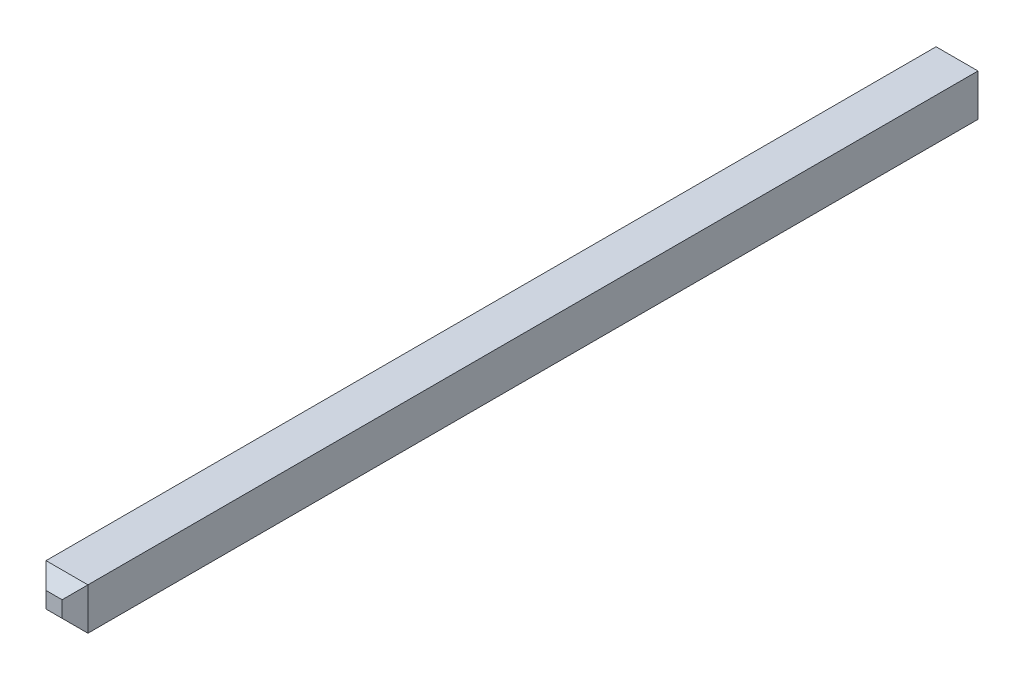
ISO-10303-21;
HEADER;
FILE_DESCRIPTION(('STEP AP214'),'2;1');
FILE_NAME('part.step','',(''),(''),'','','');
FILE_SCHEMA(('AUTOMOTIVE_DESIGN { 1 0 10303 214 1 1 1 1 }'));
ENDSEC;
DATA;
#1=APPLICATION_CONTEXT('core data for automotive mechanical design processes');
#2=APPLICATION_PROTOCOL_DEFINITION('international standard','automotive_design',2000,#1);
#3=PRODUCT_CONTEXT('',#1,'mechanical');
#4=PRODUCT('Part','Part','',(#3));
#5=PRODUCT_RELATED_PRODUCT_CATEGORY('part','',(#4));
#6=PRODUCT_DEFINITION_FORMATION('','',#4);
#7=PRODUCT_DEFINITION_CONTEXT('part definition',#1,'design');
#8=PRODUCT_DEFINITION('design','',#6,#7);
#9=PRODUCT_DEFINITION_SHAPE('','',#8);
#10=(LENGTH_UNIT() NAMED_UNIT(*) SI_UNIT(.MILLI.,.METRE.));
#11=(NAMED_UNIT(*) PLANE_ANGLE_UNIT() SI_UNIT($,.RADIAN.));
#12=(NAMED_UNIT(*) SI_UNIT($,.STERADIAN.) SOLID_ANGLE_UNIT());
#13=UNCERTAINTY_MEASURE_WITH_UNIT(LENGTH_MEASURE(1.E-05),#10,'distance_accuracy_value','');
#14=(GEOMETRIC_REPRESENTATION_CONTEXT(3) GLOBAL_UNCERTAINTY_ASSIGNED_CONTEXT((#13)) GLOBAL_UNIT_ASSIGNED_CONTEXT((#10,
#11,#12)) REPRESENTATION_CONTEXT('',''));
#15=CARTESIAN_POINT('',(0.,0.,0.));
#16=DIRECTION('',(0.,0.,1.));
#17=DIRECTION('',(1.,0.,0.));
#18=AXIS2_PLACEMENT_3D('',#15,#16,#17);
#19=CARTESIAN_POINT('',(-0.225,0.,-0.1));
#20=DIRECTION('',(-0.707106781186548,0.,0.707106781186548));
#21=DIRECTION('',(0.707106781186548,0.,0.707106781186548));
#22=AXIS2_PLACEMENT_3D('',#19,#20,#21);
#23=PLANE('',#22);
#24=DIRECTION('',(0.,1.,0.));
#25=VECTOR('',#24,1.);
#26=CARTESIAN_POINT('',(-0.325,0.325,-0.2));
#27=LINE('',#26,#25);
#28=CARTESIAN_POINT('',(-0.325,-0.325,-0.2));
#29=VERTEX_POINT('',#28);
#30=CARTESIAN_POINT('',(-0.325,0.325,-0.2));
#31=VERTEX_POINT('',#30);
#32=EDGE_CURVE('E96',#29,#31,#27,.T.);
#33=ORIENTED_EDGE('',*,*,#32,.F.);
#34=DIRECTION('',(-0.577350269189626,-0.577350269189626,-0.577350269189626));
#35=VECTOR('',#34,1.);
#36=CARTESIAN_POINT('',(-0.125,-0.125,0.));
#37=LINE('',#36,#35);
#38=CARTESIAN_POINT('',(-0.125,-0.125,0.));
#39=VERTEX_POINT('',#38);
#40=EDGE_CURVE('E94',#39,#29,#37,.T.);
#41=ORIENTED_EDGE('',*,*,#40,.F.);
#42=DIRECTION('',(0.,1.,0.));
#43=VECTOR('',#42,1.);
#44=CARTESIAN_POINT('',(-0.125,0.,0.));
#45=LINE('',#44,#43);
#46=CARTESIAN_POINT('',(-0.125,0.125,0.));
#47=VERTEX_POINT('',#46);
#48=EDGE_CURVE('E20',#47,#39,#45,.F.);
#49=ORIENTED_EDGE('',*,*,#48,.F.);
#50=DIRECTION('',(0.577350269189626,-0.577350269189626,0.577350269189626));
#51=VECTOR('',#50,1.);
#52=CARTESIAN_POINT('',(-0.325,0.325,-0.2));
#53=LINE('',#52,#51);
#54=EDGE_CURVE('E112',#31,#47,#53,.T.);
#55=ORIENTED_EDGE('',*,*,#54,.F.);
#56=EDGE_LOOP('',(#33,#41,#49,#55));
#57=FACE_BOUND('',#56,.T.);
#58=ADVANCED_FACE('F17',(#57),#23,.T.);
#59=CARTESIAN_POINT('',(-0.225,0.,-14.1));
#60=DIRECTION('',(-0.707106781186548,0.,-0.707106781186548));
#61=DIRECTION('',(-0.707106781186548,0.,0.707106781186548));
#62=AXIS2_PLACEMENT_3D('',#59,#60,#61);
#63=PLANE('',#62);
#64=DIRECTION('',(0.,1.,0.));
#65=VECTOR('',#64,1.);
#66=CARTESIAN_POINT('',(-0.125,0.,-14.2));
#67=LINE('',#66,#65);
#68=CARTESIAN_POINT('',(-0.125,0.125,-14.2));
#69=VERTEX_POINT('',#68);
#70=CARTESIAN_POINT('',(-0.125,-0.125,-14.2));
#71=VERTEX_POINT('',#70);
#72=EDGE_CURVE('E79',#69,#71,#67,.F.);
#73=ORIENTED_EDGE('',*,*,#72,.T.);
#74=DIRECTION('',(0.577350269189625,0.577350269189626,-0.577350269189626));
#75=VECTOR('',#74,1.);
#76=CARTESIAN_POINT('',(-0.325,-0.325000000000001,-14.));
#77=LINE('',#76,#75);
#78=CARTESIAN_POINT('',(-0.325,-0.325,-14.));
#79=VERTEX_POINT('',#78);
#80=EDGE_CURVE('E106',#79,#71,#77,.T.);
#81=ORIENTED_EDGE('',*,*,#80,.F.);
#82=DIRECTION('',(0.,1.,0.));
#83=VECTOR('',#82,1.);
#84=CARTESIAN_POINT('',(-0.325,0.325,-14.));
#85=LINE('',#84,#83);
#86=CARTESIAN_POINT('',(-0.325,0.325,-14.));
#87=VERTEX_POINT('',#86);
#88=EDGE_CURVE('E121',#87,#79,#85,.F.);
#89=ORIENTED_EDGE('',*,*,#88,.F.);
#90=DIRECTION('',(-0.577350269189625,0.577350269189626,0.577350269189626));
#91=VECTOR('',#90,1.);
#92=CARTESIAN_POINT('',(-0.125,0.125,-14.2));
#93=LINE('',#92,#91);
#94=EDGE_CURVE('E118',#69,#87,#93,.T.);
#95=ORIENTED_EDGE('',*,*,#94,.F.);
#96=EDGE_LOOP('',(#73,#81,#89,#95));
#97=FACE_BOUND('',#96,.T.);
#98=ADVANCED_FACE('F283',(#97),#63,.T.);
#99=CARTESIAN_POINT('',(0.,0.,0.));
#100=DIRECTION('',(0.,0.,1.));
#101=DIRECTION('',(1.,0.,0.));
#102=AXIS2_PLACEMENT_3D('',#99,#100,#101);
#103=PLANE('',#102);
#104=ORIENTED_EDGE('',*,*,#48,.T.);
#105=DIRECTION('',(1.,0.,0.));
#106=VECTOR('',#105,1.);
#107=CARTESIAN_POINT('',(0.,-0.125,0.));
#108=LINE('',#107,#106);
#109=CARTESIAN_POINT('',(0.125,-0.125,0.));
#110=VERTEX_POINT('',#109);
#111=EDGE_CURVE('E88',#110,#39,#108,.F.);
#112=ORIENTED_EDGE('',*,*,#111,.F.);
#113=DIRECTION('',(0.,1.,0.));
#114=VECTOR('',#113,1.);
#115=CARTESIAN_POINT('',(0.125,0.,0.));
#116=LINE('',#115,#114);
#117=CARTESIAN_POINT('',(0.125,0.125,0.));
#118=VERTEX_POINT('',#117);
#119=EDGE_CURVE('E127',#118,#110,#116,.F.);
#120=ORIENTED_EDGE('',*,*,#119,.F.);
#121=DIRECTION('',(1.,0.,0.));
#122=VECTOR('',#121,1.);
#123=CARTESIAN_POINT('',(0.,0.125,0.));
#124=LINE('',#123,#122);
#125=EDGE_CURVE('E90',#47,#118,#124,.T.);
#126=ORIENTED_EDGE('',*,*,#125,.F.);
#127=EDGE_LOOP('',(#104,#112,#120,#126));
#128=FACE_BOUND('',#127,.T.);
#129=ADVANCED_FACE('F85',(#128),#103,.T.);
#130=CARTESIAN_POINT('',(0.,-0.225,-0.1));
#131=DIRECTION('',(0.,-0.707106781186548,0.707106781186548));
#132=DIRECTION('',(0.,-0.707106781186548,-0.707106781186548));
#133=AXIS2_PLACEMENT_3D('',#130,#131,#132);
#134=PLANE('',#133);
#135=ORIENTED_EDGE('',*,*,#111,.T.);
#136=ORIENTED_EDGE('',*,*,#40,.T.);
#137=DIRECTION('',(1.,0.,0.));
#138=VECTOR('',#137,1.);
#139=CARTESIAN_POINT('',(-0.325,-0.325,-0.2));
#140=LINE('',#139,#138);
#141=CARTESIAN_POINT('',(0.325,-0.325,-0.2));
#142=VERTEX_POINT('',#141);
#143=EDGE_CURVE('E130',#142,#29,#140,.F.);
#144=ORIENTED_EDGE('',*,*,#143,.F.);
#145=DIRECTION('',(0.577350269189626,-0.577350269189626,-0.577350269189626));
#146=VECTOR('',#145,1.);
#147=CARTESIAN_POINT('',(0.125,-0.125,0.));
#148=LINE('',#147,#146);
#149=EDGE_CURVE('E102',#110,#142,#148,.T.);
#150=ORIENTED_EDGE('',*,*,#149,.F.);
#151=EDGE_LOOP('',(#135,#136,#144,#150));
#152=FACE_BOUND('',#151,.T.);
#153=ADVANCED_FACE('F100',(#152),#134,.T.);
#154=CARTESIAN_POINT('',(0.,0.,-14.2));
#155=DIRECTION('',(0.,0.,1.));
#156=DIRECTION('',(1.,0.,0.));
#157=AXIS2_PLACEMENT_3D('',#154,#155,#156);
#158=PLANE('',#157);
#159=DIRECTION('',(0.,1.,0.));
#160=VECTOR('',#159,1.);
#161=CARTESIAN_POINT('',(0.125,0.,-14.2));
#162=LINE('',#161,#160);
#163=CARTESIAN_POINT('',(0.125,-0.125,-14.2));
#164=VERTEX_POINT('',#163);
#165=CARTESIAN_POINT('',(0.125,0.125,-14.2));
#166=VERTEX_POINT('',#165);
#167=EDGE_CURVE('E139',#164,#166,#162,.T.);
#168=ORIENTED_EDGE('',*,*,#167,.F.);
#169=DIRECTION('',(1.,0.,0.));
#170=VECTOR('',#169,1.);
#171=CARTESIAN_POINT('',(0.,-0.125,-14.2));
#172=LINE('',#171,#170);
#173=EDGE_CURVE('E109',#71,#164,#172,.T.);
#174=ORIENTED_EDGE('',*,*,#173,.F.);
#175=ORIENTED_EDGE('',*,*,#72,.F.);
#176=DIRECTION('',(1.,0.,0.));
#177=VECTOR('',#176,1.);
#178=CARTESIAN_POINT('',(0.,0.125,-14.2));
#179=LINE('',#178,#177);
#180=EDGE_CURVE('E115',#166,#69,#179,.F.);
#181=ORIENTED_EDGE('',*,*,#180,.F.);
#182=EDGE_LOOP('',(#168,#174,#175,#181));
#183=FACE_BOUND('',#182,.T.);
#184=ADVANCED_FACE('F259',(#183),#158,.F.);
#185=CARTESIAN_POINT('',(0.,-0.225,-14.1));
#186=DIRECTION('',(0.,-0.707106781186548,-0.707106781186548));
#187=DIRECTION('',(0.,0.707106781186548,-0.707106781186548));
#188=AXIS2_PLACEMENT_3D('',#185,#186,#187);
#189=PLANE('',#188);
#190=ORIENTED_EDGE('',*,*,#173,.T.);
#191=DIRECTION('',(-0.577350269189626,0.577350269189625,-0.577350269189626));
#192=VECTOR('',#191,1.);
#193=CARTESIAN_POINT('',(0.325000000000001,-0.325,-14.));
#194=LINE('',#193,#192);
#195=CARTESIAN_POINT('',(0.325,-0.325,-14.));
#196=VERTEX_POINT('',#195);
#197=EDGE_CURVE('E144',#196,#164,#194,.T.);
#198=ORIENTED_EDGE('',*,*,#197,.F.);
#199=DIRECTION('',(1.,0.,0.));
#200=VECTOR('',#199,1.);
#201=CARTESIAN_POINT('',(-0.325,-0.325,-14.));
#202=LINE('',#201,#200);
#203=EDGE_CURVE('E136',#79,#196,#202,.T.);
#204=ORIENTED_EDGE('',*,*,#203,.F.);
#205=ORIENTED_EDGE('',*,*,#80,.T.);
#206=EDGE_LOOP('',(#190,#198,#204,#205));
#207=FACE_BOUND('',#206,.T.);
#208=ADVANCED_FACE('F251',(#207),#189,.T.);
#209=CARTESIAN_POINT('',(0.,0.225,-0.1));
#210=DIRECTION('',(0.,0.707106781186548,0.707106781186548));
#211=DIRECTION('',(0.,-0.707106781186548,0.707106781186548));
#212=AXIS2_PLACEMENT_3D('',#209,#210,#211);
#213=PLANE('',#212);
#214=ORIENTED_EDGE('',*,*,#125,.T.);
#215=DIRECTION('',(-0.577350269189626,-0.577350269189626,0.577350269189626));
#216=VECTOR('',#215,1.);
#217=CARTESIAN_POINT('',(0.325,0.325,-0.2));
#218=LINE('',#217,#216);
#219=CARTESIAN_POINT('',(0.325,0.325,-0.2));
#220=VERTEX_POINT('',#219);
#221=EDGE_CURVE('E124',#220,#118,#218,.T.);
#222=ORIENTED_EDGE('',*,*,#221,.F.);
#223=DIRECTION('',(1.,0.,0.));
#224=VECTOR('',#223,1.);
#225=CARTESIAN_POINT('',(0.325,0.325,-0.2));
#226=LINE('',#225,#224);
#227=EDGE_CURVE('E147',#31,#220,#226,.T.);
#228=ORIENTED_EDGE('',*,*,#227,.F.);
#229=ORIENTED_EDGE('',*,*,#54,.T.);
#230=EDGE_LOOP('',(#214,#222,#228,#229));
#231=FACE_BOUND('',#230,.T.);
#232=ADVANCED_FACE('F173',(#231),#213,.T.);
#233=CARTESIAN_POINT('',(0.,0.225,-14.1));
#234=DIRECTION('',(0.,0.707106781186548,-0.707106781186548));
#235=DIRECTION('',(0.,0.707106781186548,0.707106781186548));
#236=AXIS2_PLACEMENT_3D('',#233,#234,#235);
#237=PLANE('',#236);
#238=DIRECTION('',(1.,0.,0.));
#239=VECTOR('',#238,1.);
#240=CARTESIAN_POINT('',(0.325,0.325,-14.));
#241=LINE('',#240,#239);
#242=CARTESIAN_POINT('',(0.325,0.325,-14.));
#243=VERTEX_POINT('',#242);
#244=EDGE_CURVE('E35',#243,#87,#241,.F.);
#245=ORIENTED_EDGE('',*,*,#244,.F.);
#246=DIRECTION('',(0.577350269189626,0.577350269189625,0.577350269189626));
#247=VECTOR('',#246,1.);
#248=CARTESIAN_POINT('',(0.125,0.125,-14.2));
#249=LINE('',#248,#247);
#250=EDGE_CURVE('E142',#166,#243,#249,.T.);
#251=ORIENTED_EDGE('',*,*,#250,.F.);
#252=ORIENTED_EDGE('',*,*,#180,.T.);
#253=ORIENTED_EDGE('',*,*,#94,.T.);
#254=EDGE_LOOP('',(#245,#251,#252,#253));
#255=FACE_BOUND('',#254,.T.);
#256=ADVANCED_FACE('F190',(#255),#237,.T.);
#257=CARTESIAN_POINT('',(-0.325,0.325,0.));
#258=DIRECTION('',(-1.,0.,0.));
#259=DIRECTION('',(0.,0.,1.));
#260=AXIS2_PLACEMENT_3D('',#257,#258,#259);
#261=PLANE('',#260);
#262=ORIENTED_EDGE('',*,*,#88,.T.);
#263=DIRECTION('',(0.,0.,-1.));
#264=VECTOR('',#263,1.);
#265=CARTESIAN_POINT('',(-0.325,-0.325,0.));
#266=LINE('',#265,#264);
#267=EDGE_CURVE('E133',#29,#79,#266,.T.);
#268=ORIENTED_EDGE('',*,*,#267,.F.);
#269=ORIENTED_EDGE('',*,*,#32,.T.);
#270=DIRECTION('',(0.,0.,1.));
#271=VECTOR('',#270,1.);
#272=CARTESIAN_POINT('',(-0.325,0.325,0.));
#273=LINE('',#272,#271);
#274=EDGE_CURVE('E151',#87,#31,#273,.T.);
#275=ORIENTED_EDGE('',*,*,#274,.F.);
#276=EDGE_LOOP('',(#262,#268,#269,#275));
#277=FACE_BOUND('',#276,.T.);
#278=ADVANCED_FACE('F176',(#277),#261,.T.);
#279=CARTESIAN_POINT('',(0.225,0.,-0.1));
#280=DIRECTION('',(0.707106781186548,0.,0.707106781186548));
#281=DIRECTION('',(0.707106781186548,0.,-0.707106781186548));
#282=AXIS2_PLACEMENT_3D('',#279,#280,#281);
#283=PLANE('',#282);
#284=ORIENTED_EDGE('',*,*,#119,.T.);
#285=ORIENTED_EDGE('',*,*,#149,.T.);
#286=DIRECTION('',(0.,1.,0.));
#287=VECTOR('',#286,1.);
#288=CARTESIAN_POINT('',(0.325,-0.325,-0.2));
#289=LINE('',#288,#287);
#290=EDGE_CURVE('E154',#220,#142,#289,.F.);
#291=ORIENTED_EDGE('',*,*,#290,.F.);
#292=ORIENTED_EDGE('',*,*,#221,.T.);
#293=EDGE_LOOP('',(#284,#285,#291,#292));
#294=FACE_BOUND('',#293,.T.);
#295=ADVANCED_FACE('F181',(#294),#283,.T.);
#296=CARTESIAN_POINT('',(-0.325,-0.325,0.));
#297=DIRECTION('',(0.,-1.,0.));
#298=DIRECTION('',(0.,0.,-1.));
#299=AXIS2_PLACEMENT_3D('',#296,#297,#298);
#300=PLANE('',#299);
#301=ORIENTED_EDGE('',*,*,#203,.T.);
#302=DIRECTION('',(0.,0.,-1.));
#303=VECTOR('',#302,1.);
#304=CARTESIAN_POINT('',(0.325,-0.325,0.));
#305=LINE('',#304,#303);
#306=EDGE_CURVE('E157',#142,#196,#305,.T.);
#307=ORIENTED_EDGE('',*,*,#306,.F.);
#308=ORIENTED_EDGE('',*,*,#143,.T.);
#309=ORIENTED_EDGE('',*,*,#267,.T.);
#310=EDGE_LOOP('',(#301,#307,#308,#309));
#311=FACE_BOUND('',#310,.T.);
#312=ADVANCED_FACE('F179',(#311),#300,.T.);
#313=CARTESIAN_POINT('',(0.225,0.,-14.1));
#314=DIRECTION('',(0.707106781186548,0.,-0.707106781186548));
#315=DIRECTION('',(-0.707106781186548,0.,-0.707106781186548));
#316=AXIS2_PLACEMENT_3D('',#313,#314,#315);
#317=PLANE('',#316);
#318=DIRECTION('',(0.,1.,0.));
#319=VECTOR('',#318,1.);
#320=CARTESIAN_POINT('',(0.325,-0.325,-14.));
#321=LINE('',#320,#319);
#322=EDGE_CURVE('E26',#196,#243,#321,.T.);
#323=ORIENTED_EDGE('',*,*,#322,.F.);
#324=ORIENTED_EDGE('',*,*,#197,.T.);
#325=ORIENTED_EDGE('',*,*,#167,.T.);
#326=ORIENTED_EDGE('',*,*,#250,.T.);
#327=EDGE_LOOP('',(#323,#324,#325,#326));
#328=FACE_BOUND('',#327,.T.);
#329=ADVANCED_FACE('F167',(#328),#317,.T.);
#330=CARTESIAN_POINT('',(0.325,0.325,0.));
#331=DIRECTION('',(0.,1.,0.));
#332=DIRECTION('',(0.,0.,1.));
#333=AXIS2_PLACEMENT_3D('',#330,#331,#332);
#334=PLANE('',#333);
#335=ORIENTED_EDGE('',*,*,#244,.T.);
#336=ORIENTED_EDGE('',*,*,#274,.T.);
#337=ORIENTED_EDGE('',*,*,#227,.T.);
#338=DIRECTION('',(0.,0.,-1.));
#339=VECTOR('',#338,1.);
#340=CARTESIAN_POINT('',(0.325,0.325,0.));
#341=LINE('',#340,#339);
#342=EDGE_CURVE('E11',#243,#220,#341,.F.);
#343=ORIENTED_EDGE('',*,*,#342,.F.);
#344=EDGE_LOOP('',(#335,#336,#337,#343));
#345=FACE_BOUND('',#344,.T.);
#346=ADVANCED_FACE('F169',(#345),#334,.T.);
#347=CARTESIAN_POINT('',(0.325,-0.325,0.));
#348=DIRECTION('',(1.,0.,0.));
#349=DIRECTION('',(0.,0.,-1.));
#350=AXIS2_PLACEMENT_3D('',#347,#348,#349);
#351=PLANE('',#350);
#352=ORIENTED_EDGE('',*,*,#322,.T.);
#353=ORIENTED_EDGE('',*,*,#342,.T.);
#354=ORIENTED_EDGE('',*,*,#290,.T.);
#355=ORIENTED_EDGE('',*,*,#306,.T.);
#356=EDGE_LOOP('',(#352,#353,#354,#355));
#357=FACE_BOUND('',#356,.T.);
#358=ADVANCED_FACE('F163',(#357),#351,.T.);
#359=CLOSED_SHELL('',(#58,#98,#129,#153,#184,#208,#232,#256,#278,#295,#312,#329,#346,#358));
#360=MANIFOLD_SOLID_BREP('B1',#359);
#361=ADVANCED_BREP_SHAPE_REPRESENTATION('',(#18,#360),#14);
#362=SHAPE_DEFINITION_REPRESENTATION(#9,#361);
ENDSEC;
END-ISO-10303-21;
